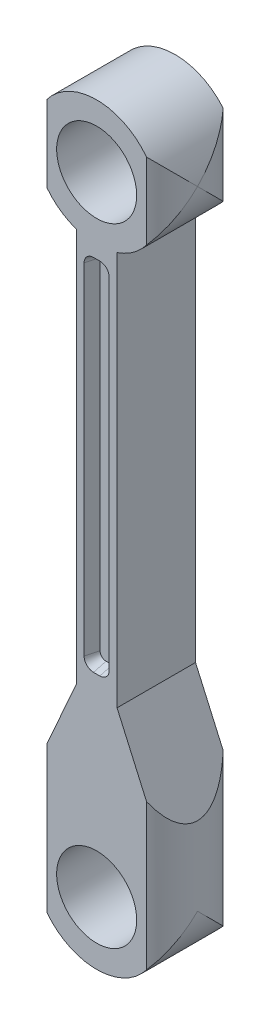
ISO-10303-21;
HEADER;
FILE_DESCRIPTION(('STEP AP214'),'2;1');
FILE_NAME('part.step','',(''),(''),'','','');
FILE_SCHEMA(('AUTOMOTIVE_DESIGN { 1 0 10303 214 1 1 1 1 }'));
ENDSEC;
DATA;
#1=APPLICATION_CONTEXT('core data for automotive mechanical design processes');
#2=APPLICATION_PROTOCOL_DEFINITION('international standard','automotive_design',2000,#1);
#3=PRODUCT_CONTEXT('',#1,'mechanical');
#4=PRODUCT('Part','Part','',(#3));
#5=PRODUCT_RELATED_PRODUCT_CATEGORY('part','',(#4));
#6=PRODUCT_DEFINITION_FORMATION('','',#4);
#7=PRODUCT_DEFINITION_CONTEXT('part definition',#1,'design');
#8=PRODUCT_DEFINITION('design','',#6,#7);
#9=PRODUCT_DEFINITION_SHAPE('','',#8);
#10=(LENGTH_UNIT() NAMED_UNIT(*) SI_UNIT(.MILLI.,.METRE.));
#11=(NAMED_UNIT(*) PLANE_ANGLE_UNIT() SI_UNIT($,.RADIAN.));
#12=(NAMED_UNIT(*) SI_UNIT($,.STERADIAN.) SOLID_ANGLE_UNIT());
#13=UNCERTAINTY_MEASURE_WITH_UNIT(LENGTH_MEASURE(1.E-05),#10,'distance_accuracy_value','');
#14=(GEOMETRIC_REPRESENTATION_CONTEXT(3) GLOBAL_UNCERTAINTY_ASSIGNED_CONTEXT((#13)) GLOBAL_UNIT_ASSIGNED_CONTEXT((#10,
#11,#12)) REPRESENTATION_CONTEXT('',''));
#15=CARTESIAN_POINT('',(0.,0.,0.));
#16=DIRECTION('',(0.,0.,1.));
#17=DIRECTION('',(1.,0.,0.));
#18=AXIS2_PLACEMENT_3D('',#15,#16,#17);
#19=CARTESIAN_POINT('',(0.,0.,-12.7));
#20=DIRECTION('',(0.,0.,1.));
#21=DIRECTION('',(1.,0.,0.));
#22=AXIS2_PLACEMENT_3D('',#19,#20,#21);
#23=PLANE('',#22);
#24=CARTESIAN_POINT('',(0.,0.,-12.7));
#25=DIRECTION('',(0.,0.,1.));
#26=DIRECTION('',(1.,0.,0.));
#27=AXIS2_PLACEMENT_3D('',#24,#25,#26);
#28=CIRCLE('',#27,6.477);
#29=CARTESIAN_POINT('',(6.477,0.,-12.7));
#30=VERTEX_POINT('',#29);
#31=EDGE_CURVE('E288',#30,#30,#28,.T.);
#32=ORIENTED_EDGE('',*,*,#31,.T.);
#33=EDGE_LOOP('',(#32));
#34=FACE_BOUND('',#33,.T.);
#35=CARTESIAN_POINT('',(0.,101.6,-12.7));
#36=DIRECTION('',(0.,0.,1.));
#37=DIRECTION('',(1.,0.,0.));
#38=AXIS2_PLACEMENT_3D('',#35,#36,#37);
#39=CIRCLE('',#38,6.477);
#40=CARTESIAN_POINT('',(6.477,101.6,-12.7));
#41=VERTEX_POINT('',#40);
#42=EDGE_CURVE('E524',#41,#41,#39,.T.);
#43=ORIENTED_EDGE('',*,*,#42,.T.);
#44=EDGE_LOOP('',(#43));
#45=FACE_BOUND('',#44,.T.);
#46=CARTESIAN_POINT('',(0.508000000000007,32.766,-12.7));
#47=DIRECTION('',(0.,0.,1.));
#48=DIRECTION('',(1.,0.,0.));
#49=AXIS2_PLACEMENT_3D('',#46,#47,#48);
#50=CIRCLE('',#49,1.524);
#51=CARTESIAN_POINT('',(0.508,31.242,-12.7));
#52=VERTEX_POINT('',#51);
#53=CARTESIAN_POINT('',(2.03200000000001,32.766,-12.7));
#54=VERTEX_POINT('',#53);
#55=EDGE_CURVE('E400',#52,#54,#50,.T.);
#56=ORIENTED_EDGE('',*,*,#55,.T.);
#57=DIRECTION('',(0.,1.,0.));
#58=VECTOR('',#57,1.);
#59=CARTESIAN_POINT('',(2.032,87.884,-12.7));
#60=LINE('',#59,#58);
#61=CARTESIAN_POINT('',(2.032,87.884,-12.7));
#62=VERTEX_POINT('',#61);
#63=EDGE_CURVE('E421',#54,#62,#60,.T.);
#64=ORIENTED_EDGE('',*,*,#63,.T.);
#65=CARTESIAN_POINT('',(0.508,87.884,-12.7));
#66=DIRECTION('',(0.,0.,1.));
#67=DIRECTION('',(-1.,0.,0.));
#68=AXIS2_PLACEMENT_3D('',#65,#66,#67);
#69=CIRCLE('',#68,1.524);
#70=CARTESIAN_POINT('',(0.50799999999999,89.408,-12.7));
#71=VERTEX_POINT('',#70);
#72=EDGE_CURVE('E418',#62,#71,#69,.T.);
#73=ORIENTED_EDGE('',*,*,#72,.T.);
#74=DIRECTION('',(-1.,0.,0.));
#75=VECTOR('',#74,1.);
#76=CARTESIAN_POINT('',(-0.507999999999988,89.408,-12.7));
#77=LINE('',#76,#75);
#78=CARTESIAN_POINT('',(-0.507999999999988,89.408,-12.7));
#79=VERTEX_POINT('',#78);
#80=EDGE_CURVE('E415',#71,#79,#77,.T.);
#81=ORIENTED_EDGE('',*,*,#80,.T.);
#82=CARTESIAN_POINT('',(-0.507999999999999,87.884,-12.7));
#83=DIRECTION('',(0.,0.,1.));
#84=DIRECTION('',(1.,0.,0.));
#85=AXIS2_PLACEMENT_3D('',#82,#83,#84);
#86=CIRCLE('',#85,1.524);
#87=CARTESIAN_POINT('',(-2.032,87.884,-12.7));
#88=VERTEX_POINT('',#87);
#89=EDGE_CURVE('E412',#79,#88,#86,.T.);
#90=ORIENTED_EDGE('',*,*,#89,.T.);
#91=DIRECTION('',(0.,-1.,0.));
#92=VECTOR('',#91,1.);
#93=CARTESIAN_POINT('',(-2.032,87.884,-12.7));
#94=LINE('',#93,#92);
#95=CARTESIAN_POINT('',(-2.03199999999999,32.766,-12.7));
#96=VERTEX_POINT('',#95);
#97=EDGE_CURVE('E409',#88,#96,#94,.T.);
#98=ORIENTED_EDGE('',*,*,#97,.T.);
#99=CARTESIAN_POINT('',(-0.507999999999992,32.766,-12.7));
#100=DIRECTION('',(0.,0.,1.));
#101=DIRECTION('',(1.,0.,0.));
#102=AXIS2_PLACEMENT_3D('',#99,#100,#101);
#103=CIRCLE('',#102,1.524);
#104=CARTESIAN_POINT('',(-0.507999999999981,31.242,-12.7));
#105=VERTEX_POINT('',#104);
#106=EDGE_CURVE('E406',#96,#105,#103,.T.);
#107=ORIENTED_EDGE('',*,*,#106,.T.);
#108=DIRECTION('',(1.,0.,0.));
#109=VECTOR('',#108,1.);
#110=CARTESIAN_POINT('',(-0.507999999999981,31.242,-12.7));
#111=LINE('',#110,#109);
#112=EDGE_CURVE('E403',#105,#52,#111,.T.);
#113=ORIENTED_EDGE('',*,*,#112,.T.);
#114=EDGE_LOOP('',(#56,#64,#73,#81,#90,#98,#107,#113));
#115=FACE_BOUND('',#114,.T.);
#116=DIRECTION('',(0.,1.,0.));
#117=VECTOR('',#116,1.);
#118=CARTESIAN_POINT('',(7.78261659931922,-10.16,-12.7));
#119=LINE('',#118,#117);
#120=CARTESIAN_POINT('',(7.78261659931922,-6.53119275997891,-12.7));
#121=VERTEX_POINT('',#120);
#122=CARTESIAN_POINT('',(7.78261659931922,18.0648705739055,-12.7));
#123=VERTEX_POINT('',#122);
#124=EDGE_CURVE('E336',#121,#123,#119,.T.);
#125=ORIENTED_EDGE('',*,*,#124,.F.);
#126=CARTESIAN_POINT('',(0.,0.,-12.7));
#127=DIRECTION('',(0.,0.,1.));
#128=DIRECTION('',(1.,0.,0.));
#129=AXIS2_PLACEMENT_3D('',#126,#127,#128);
#130=CIRCLE('',#129,10.16);
#131=CARTESIAN_POINT('',(-7.78261659931922,-6.53119275997891,-12.7));
#132=VERTEX_POINT('',#131);
#133=EDGE_CURVE('E257',#132,#121,#130,.T.);
#134=ORIENTED_EDGE('',*,*,#133,.F.);
#135=DIRECTION('',(0.,1.,0.));
#136=VECTOR('',#135,1.);
#137=CARTESIAN_POINT('',(-7.78261659931922,-10.16,-12.7));
#138=LINE('',#137,#136);
#139=CARTESIAN_POINT('',(-7.78261659931922,18.0648705739055,-12.7));
#140=VERTEX_POINT('',#139);
#141=EDGE_CURVE('E310',#140,#132,#138,.F.);
#142=ORIENTED_EDGE('',*,*,#141,.F.);
#143=DIRECTION('',(-0.405141586779863,-0.914253955234263,0.));
#144=VECTOR('',#143,1.);
#145=CARTESIAN_POINT('',(-10.16,12.7,-12.7));
#146=LINE('',#145,#144);
#147=CARTESIAN_POINT('',(-3.302,28.1759566274874,-12.7));
#148=VERTEX_POINT('',#147);
#149=EDGE_CURVE('E240',#148,#140,#146,.T.);
#150=ORIENTED_EDGE('',*,*,#149,.F.);
#151=DIRECTION('',(0.,-1.,0.));
#152=VECTOR('',#151,1.);
#153=CARTESIAN_POINT('',(-3.302,28.1759566274874,-12.7));
#154=LINE('',#153,#152);
#155=CARTESIAN_POINT('',(-3.302,91.9915455977561,-12.7));
#156=VERTEX_POINT('',#155);
#157=EDGE_CURVE('E278',#156,#148,#154,.T.);
#158=ORIENTED_EDGE('',*,*,#157,.F.);
#159=CARTESIAN_POINT('',(0.,101.6,-12.7));
#160=DIRECTION('',(0.,0.,1.));
#161=DIRECTION('',(1.,0.,0.));
#162=AXIS2_PLACEMENT_3D('',#159,#160,#161);
#163=CIRCLE('',#162,10.16);
#164=CARTESIAN_POINT('',(-7.78261659931922,95.0688072400211,-12.7));
#165=VERTEX_POINT('',#164);
#166=EDGE_CURVE('E303',#165,#156,#163,.T.);
#167=ORIENTED_EDGE('',*,*,#166,.F.);
#168=CARTESIAN_POINT('',(-7.78261659931922,108.131192759979,-12.7));
#169=VERTEX_POINT('',#168);
#170=EDGE_CURVE('E314',#169,#165,#138,.F.);
#171=ORIENTED_EDGE('',*,*,#170,.F.);
#172=CARTESIAN_POINT('',(7.78261659931922,108.131192759979,-12.7));
#173=VERTEX_POINT('',#172);
#174=EDGE_CURVE('E536',#173,#169,#163,.T.);
#175=ORIENTED_EDGE('',*,*,#174,.F.);
#176=CARTESIAN_POINT('',(7.78261659931922,95.0688072400211,-12.7));
#177=VERTEX_POINT('',#176);
#178=EDGE_CURVE('E332',#177,#173,#119,.T.);
#179=ORIENTED_EDGE('',*,*,#178,.F.);
#180=CARTESIAN_POINT('',(3.30199999999999,91.9915455977561,-12.7));
#181=VERTEX_POINT('',#180);
#182=EDGE_CURVE('E281',#181,#177,#163,.T.);
#183=ORIENTED_EDGE('',*,*,#182,.F.);
#184=DIRECTION('',(0.,1.,0.));
#185=VECTOR('',#184,1.);
#186=CARTESIAN_POINT('',(3.302,28.1759566274874,-12.7));
#187=LINE('',#186,#185);
#188=CARTESIAN_POINT('',(3.302,28.1759566274874,-12.7));
#189=VERTEX_POINT('',#188);
#190=EDGE_CURVE('E534',#189,#181,#187,.T.);
#191=ORIENTED_EDGE('',*,*,#190,.F.);
#192=DIRECTION('',(-0.405141586779863,0.914253955234263,0.));
#193=VECTOR('',#192,1.);
#194=CARTESIAN_POINT('',(10.16,12.7,-12.7));
#195=LINE('',#194,#193);
#196=EDGE_CURVE('E260',#123,#189,#195,.T.);
#197=ORIENTED_EDGE('',*,*,#196,.F.);
#198=EDGE_LOOP('',(#125,#134,#142,#150,#158,#167,#171,#175,#179,#183,#191,#197));
#199=FACE_BOUND('',#198,.T.);
#200=ADVANCED_FACE('F34',(#34,#45,#115,#199),#23,.F.);
#201=CARTESIAN_POINT('',(0.,0.,-12.7));
#202=DIRECTION('',(0.,0.,1.));
#203=DIRECTION('',(1.,0.,0.));
#204=AXIS2_PLACEMENT_3D('',#201,#202,#203);
#205=CYLINDRICAL_SURFACE('',#204,10.16);
#206=CARTESIAN_POINT('',(0.,0.,0.));
#207=DIRECTION('',(0.,0.,1.));
#208=DIRECTION('',(1.,0.,0.));
#209=AXIS2_PLACEMENT_3D('',#206,#207,#208);
#210=CIRCLE('',#209,10.16);
#211=CARTESIAN_POINT('',(-8.0728815942923,-6.16880724002109,0.));
#212=VERTEX_POINT('',#211);
#213=CARTESIAN_POINT('',(8.0728815942923,-6.16880724002109,0.));
#214=VERTEX_POINT('',#213);
#215=EDGE_CURVE('E285',#212,#214,#210,.T.);
#216=ORIENTED_EDGE('',*,*,#215,.F.);
#217=CARTESIAN_POINT('',(0.,0.,-6.16880724002109));
#218=DIRECTION('',(0.,0.707106781186547,0.707106781186547));
#219=DIRECTION('',(0.,-0.707106781186547,0.707106781186547));
#220=AXIS2_PLACEMENT_3D('',#217,#218,#219);
#221=ELLIPSE('',#220,14.3684097937106,10.16);
#222=CARTESIAN_POINT('',(-10.16,0.,-6.16880724002109));
#223=VERTEX_POINT('',#222);
#224=EDGE_CURVE('E243',#212,#223,#221,.F.);
#225=ORIENTED_EDGE('',*,*,#224,.T.);
#226=CARTESIAN_POINT('',(0.,0.,-6.16880724002109));
#227=DIRECTION('',(0.,-0.707106781186547,0.707106781186547));
#228=DIRECTION('',(0.,0.707106781186547,0.707106781186547));
#229=AXIS2_PLACEMENT_3D('',#226,#227,#228);
#230=ELLIPSE('',#229,14.3684097937106,10.16);
#231=EDGE_CURVE('E312',#223,#132,#230,.T.);
#232=ORIENTED_EDGE('',*,*,#231,.T.);
#233=ORIENTED_EDGE('',*,*,#133,.T.);
#234=CARTESIAN_POINT('',(10.16,0.,-6.16880724002109));
#235=VERTEX_POINT('',#234);
#236=EDGE_CURVE('E317',#121,#235,#230,.T.);
#237=ORIENTED_EDGE('',*,*,#236,.T.);
#238=EDGE_CURVE('E319',#235,#214,#221,.F.);
#239=ORIENTED_EDGE('',*,*,#238,.T.);
#240=EDGE_LOOP('',(#216,#225,#232,#233,#237,#239));
#241=FACE_BOUND('',#240,.T.);
#242=ADVANCED_FACE('F36',(#241),#205,.T.);
#243=CARTESIAN_POINT('',(-10.16,12.7,-12.7));
#244=DIRECTION('',(-0.914253955234263,0.405141586779863,0.));
#245=DIRECTION('',(-0.405141586779863,-0.914253955234263,0.));
#246=AXIS2_PLACEMENT_3D('',#243,#244,#245);
#247=PLANE('',#246);
#248=ORIENTED_EDGE('',*,*,#149,.T.);
#249=CARTESIAN_POINT('',(0.,35.6273431518332,-6.16880724002109));
#250=DIRECTION('',(-0.914253955234263,0.405141586779863,0.));
#251=DIRECTION('',(0.405141586779863,0.914253955234263,0.));
#252=AXIS2_PLACEMENT_3D('',#249,#250,#251);
#253=ELLIPSE('',#252,25.0776526812601,10.16);
#254=CARTESIAN_POINT('',(-8.0728815942923,17.4098503824968,0.));
#255=VERTEX_POINT('',#254);
#256=EDGE_CURVE('E233',#140,#255,#253,.T.);
#257=ORIENTED_EDGE('',*,*,#256,.T.);
#258=DIRECTION('',(-0.405141586779863,-0.914253955234263,0.));
#259=VECTOR('',#258,1.);
#260=CARTESIAN_POINT('',(-10.16,12.7,0.));
#261=LINE('',#260,#259);
#262=CARTESIAN_POINT('',(-3.302,28.1759566274874,0.));
#263=VERTEX_POINT('',#262);
#264=EDGE_CURVE('E237',#263,#255,#261,.T.);
#265=ORIENTED_EDGE('',*,*,#264,.F.);
#266=DIRECTION('',(0.,0.,1.));
#267=VECTOR('',#266,1.);
#268=CARTESIAN_POINT('',(-3.302,28.1759566274874,-12.7));
#269=LINE('',#268,#267);
#270=EDGE_CURVE('E253',#148,#263,#269,.T.);
#271=ORIENTED_EDGE('',*,*,#270,.F.);
#272=EDGE_LOOP('',(#248,#257,#265,#271));
#273=FACE_BOUND('',#272,.T.);
#274=ADVANCED_FACE('F235',(#273),#247,.T.);
#275=CARTESIAN_POINT('',(0.,101.6,-12.7));
#276=DIRECTION('',(0.,0.,1.));
#277=DIRECTION('',(1.,0.,0.));
#278=AXIS2_PLACEMENT_3D('',#275,#276,#277);
#279=CYLINDRICAL_SURFACE('',#278,10.16);
#280=CARTESIAN_POINT('',(0.,101.6,-6.16880724002109));
#281=DIRECTION('',(0.,-0.707106781186547,0.707106781186547));
#282=DIRECTION('',(0.,0.707106781186547,0.707106781186547));
#283=AXIS2_PLACEMENT_3D('',#280,#281,#282);
#284=ELLIPSE('',#283,14.3684097937106,10.16);
#285=CARTESIAN_POINT('',(10.16,101.6,-6.16880724002109));
#286=VERTEX_POINT('',#285);
#287=EDGE_CURVE('E330',#177,#286,#284,.T.);
#288=ORIENTED_EDGE('',*,*,#287,.T.);
#289=CARTESIAN_POINT('',(0.,101.6,-6.16880724002109));
#290=DIRECTION('',(0.,0.707106781186547,0.707106781186547));
#291=DIRECTION('',(0.,-0.707106781186547,0.707106781186547));
#292=AXIS2_PLACEMENT_3D('',#289,#290,#291);
#293=ELLIPSE('',#292,14.3684097937106,10.16);
#294=CARTESIAN_POINT('',(8.0728815942923,95.4311927599789,0.));
#295=VERTEX_POINT('',#294);
#296=EDGE_CURVE('E328',#286,#295,#293,.F.);
#297=ORIENTED_EDGE('',*,*,#296,.T.);
#298=CARTESIAN_POINT('',(0.,101.6,0.));
#299=DIRECTION('',(0.,0.,1.));
#300=DIRECTION('',(1.,0.,0.));
#301=AXIS2_PLACEMENT_3D('',#298,#299,#300);
#302=CIRCLE('',#301,10.16);
#303=CARTESIAN_POINT('',(3.30199999999999,91.9915455977561,0.));
#304=VERTEX_POINT('',#303);
#305=EDGE_CURVE('E262',#304,#295,#302,.T.);
#306=ORIENTED_EDGE('',*,*,#305,.F.);
#307=DIRECTION('',(0.,0.,1.));
#308=VECTOR('',#307,1.);
#309=CARTESIAN_POINT('',(3.30199999999999,91.9915455977561,-12.7));
#310=LINE('',#309,#308);
#311=EDGE_CURVE('E270',#181,#304,#310,.T.);
#312=ORIENTED_EDGE('',*,*,#311,.F.);
#313=ORIENTED_EDGE('',*,*,#182,.T.);
#314=EDGE_LOOP('',(#288,#297,#306,#312,#313));
#315=FACE_BOUND('',#314,.T.);
#316=ADVANCED_FACE('F379',(#315),#279,.T.);
#317=CARTESIAN_POINT('',(0.,101.6,-6.16880724002109));
#318=DIRECTION('',(0.,-0.707106781186547,0.707106781186547));
#319=DIRECTION('',(0.,0.707106781186547,0.707106781186547));
#320=AXIS2_PLACEMENT_3D('',#317,#318,#319);
#321=ELLIPSE('',#320,14.3684097937106,10.16);
#322=CARTESIAN_POINT('',(8.0728815942923,107.768807240021,0.));
#323=VERTEX_POINT('',#322);
#324=EDGE_CURVE('E57',#323,#286,#321,.F.);
#325=ORIENTED_EDGE('',*,*,#324,.T.);
#326=CARTESIAN_POINT('',(0.,101.6,-6.16880724002109));
#327=DIRECTION('',(0.,0.707106781186547,0.707106781186547));
#328=DIRECTION('',(0.,-0.707106781186547,0.707106781186547));
#329=AXIS2_PLACEMENT_3D('',#326,#327,#328);
#330=ELLIPSE('',#329,14.3684097937106,10.16);
#331=EDGE_CURVE('E325',#286,#173,#330,.T.);
#332=ORIENTED_EDGE('',*,*,#331,.T.);
#333=ORIENTED_EDGE('',*,*,#174,.T.);
#334=CARTESIAN_POINT('',(-10.16,101.6,-6.16880724002109));
#335=VERTEX_POINT('',#334);
#336=EDGE_CURVE('E320',#169,#335,#330,.T.);
#337=ORIENTED_EDGE('',*,*,#336,.T.);
#338=CARTESIAN_POINT('',(-8.0728815942923,107.768807240021,0.));
#339=VERTEX_POINT('',#338);
#340=EDGE_CURVE('E315',#335,#339,#321,.F.);
#341=ORIENTED_EDGE('',*,*,#340,.T.);
#342=EDGE_CURVE('E294',#323,#339,#302,.T.);
#343=ORIENTED_EDGE('',*,*,#342,.F.);
#344=EDGE_LOOP('',(#325,#332,#333,#337,#341,#343));
#345=FACE_BOUND('',#344,.T.);
#346=ADVANCED_FACE('F342',(#345),#279,.T.);
#347=CARTESIAN_POINT('',(-8.0728815942923,95.4311927599789,0.));
#348=VERTEX_POINT('',#347);
#349=CARTESIAN_POINT('',(-3.302,91.9915455977561,0.));
#350=VERTEX_POINT('',#349);
#351=EDGE_CURVE('E292',#348,#350,#302,.T.);
#352=ORIENTED_EDGE('',*,*,#351,.F.);
#353=EDGE_CURVE('E49',#348,#335,#293,.F.);
#354=ORIENTED_EDGE('',*,*,#353,.T.);
#355=EDGE_CURVE('E326',#335,#165,#284,.T.);
#356=ORIENTED_EDGE('',*,*,#355,.T.);
#357=ORIENTED_EDGE('',*,*,#166,.T.);
#358=DIRECTION('',(0.,0.,1.));
#359=VECTOR('',#358,1.);
#360=CARTESIAN_POINT('',(-3.302,91.9915455977561,-12.7));
#361=LINE('',#360,#359);
#362=EDGE_CURVE('E267',#156,#350,#361,.T.);
#363=ORIENTED_EDGE('',*,*,#362,.T.);
#364=EDGE_LOOP('',(#352,#354,#356,#357,#363));
#365=FACE_BOUND('',#364,.T.);
#366=ADVANCED_FACE('F300',(#365),#279,.T.);
#367=CARTESIAN_POINT('',(10.16,12.7,-12.7));
#368=DIRECTION('',(0.914253955234263,0.405141586779863,0.));
#369=DIRECTION('',(-0.405141586779863,0.914253955234263,0.));
#370=AXIS2_PLACEMENT_3D('',#367,#368,#369);
#371=PLANE('',#370);
#372=DIRECTION('',(-0.405141586779863,0.914253955234263,0.));
#373=VECTOR('',#372,1.);
#374=CARTESIAN_POINT('',(10.16,12.7,0.));
#375=LINE('',#374,#373);
#376=CARTESIAN_POINT('',(8.0728815942923,17.4098503824968,0.));
#377=VERTEX_POINT('',#376);
#378=CARTESIAN_POINT('',(3.302,28.1759566274874,0.));
#379=VERTEX_POINT('',#378);
#380=EDGE_CURVE('E287',#377,#379,#375,.T.);
#381=ORIENTED_EDGE('',*,*,#380,.F.);
#382=CARTESIAN_POINT('',(0.,35.6273431518332,-6.16880724002109));
#383=DIRECTION('',(0.914253955234263,0.405141586779863,0.));
#384=DIRECTION('',(-0.405141586779863,0.914253955234263,0.));
#385=AXIS2_PLACEMENT_3D('',#382,#383,#384);
#386=ELLIPSE('',#385,25.0776526812601,10.16);
#387=EDGE_CURVE('E392',#377,#123,#386,.T.);
#388=ORIENTED_EDGE('',*,*,#387,.T.);
#389=ORIENTED_EDGE('',*,*,#196,.T.);
#390=DIRECTION('',(0.,0.,1.));
#391=VECTOR('',#390,1.);
#392=CARTESIAN_POINT('',(3.302,28.1759566274874,-12.7));
#393=LINE('',#392,#391);
#394=EDGE_CURVE('E272',#189,#379,#393,.T.);
#395=ORIENTED_EDGE('',*,*,#394,.T.);
#396=EDGE_LOOP('',(#381,#388,#389,#395));
#397=FACE_BOUND('',#396,.T.);
#398=ADVANCED_FACE('F375',(#397),#371,.T.);
#399=CARTESIAN_POINT('',(0.,0.,0.));
#400=DIRECTION('',(0.,0.,1.));
#401=DIRECTION('',(1.,0.,0.));
#402=AXIS2_PLACEMENT_3D('',#399,#400,#401);
#403=PLANE('',#402);
#404=CARTESIAN_POINT('',(0.508000000000007,32.766,0.));
#405=DIRECTION('',(0.,0.,1.));
#406=DIRECTION('',(1.,0.,0.));
#407=AXIS2_PLACEMENT_3D('',#404,#405,#406);
#408=CIRCLE('',#407,1.524);
#409=CARTESIAN_POINT('',(0.507999999999996,31.242,0.));
#410=VERTEX_POINT('',#409);
#411=CARTESIAN_POINT('',(2.03200000000001,32.766,0.));
#412=VERTEX_POINT('',#411);
#413=EDGE_CURVE('E428',#410,#412,#408,.T.);
#414=ORIENTED_EDGE('',*,*,#413,.F.);
#415=DIRECTION('',(1.,0.,0.));
#416=VECTOR('',#415,1.);
#417=CARTESIAN_POINT('',(-0.507999999999981,31.242,0.));
#418=LINE('',#417,#416);
#419=CARTESIAN_POINT('',(-0.507999999999981,31.242,0.));
#420=VERTEX_POINT('',#419);
#421=EDGE_CURVE('E479',#420,#410,#418,.T.);
#422=ORIENTED_EDGE('',*,*,#421,.F.);
#423=CARTESIAN_POINT('',(-0.507999999999992,32.766,0.));
#424=DIRECTION('',(0.,0.,1.));
#425=DIRECTION('',(1.,0.,0.));
#426=AXIS2_PLACEMENT_3D('',#423,#424,#425);
#427=CIRCLE('',#426,1.524);
#428=CARTESIAN_POINT('',(-2.03199999999999,32.766,0.));
#429=VERTEX_POINT('',#428);
#430=EDGE_CURVE('E476',#429,#420,#427,.T.);
#431=ORIENTED_EDGE('',*,*,#430,.F.);
#432=DIRECTION('',(0.,-1.,0.));
#433=VECTOR('',#432,1.);
#434=CARTESIAN_POINT('',(-2.032,87.884,0.));
#435=LINE('',#434,#433);
#436=CARTESIAN_POINT('',(-2.032,87.884,0.));
#437=VERTEX_POINT('',#436);
#438=EDGE_CURVE('E473',#437,#429,#435,.T.);
#439=ORIENTED_EDGE('',*,*,#438,.F.);
#440=CARTESIAN_POINT('',(-0.507999999999999,87.884,0.));
#441=DIRECTION('',(0.,0.,1.));
#442=DIRECTION('',(1.,0.,0.));
#443=AXIS2_PLACEMENT_3D('',#440,#441,#442);
#444=CIRCLE('',#443,1.524);
#445=CARTESIAN_POINT('',(-0.507999999999988,89.408,0.));
#446=VERTEX_POINT('',#445);
#447=EDGE_CURVE('E470',#446,#437,#444,.T.);
#448=ORIENTED_EDGE('',*,*,#447,.F.);
#449=DIRECTION('',(-1.,0.,0.));
#450=VECTOR('',#449,1.);
#451=CARTESIAN_POINT('',(-0.507999999999988,89.408,0.));
#452=LINE('',#451,#450);
#453=CARTESIAN_POINT('',(0.50799999999999,89.408,0.));
#454=VERTEX_POINT('',#453);
#455=EDGE_CURVE('E467',#454,#446,#452,.T.);
#456=ORIENTED_EDGE('',*,*,#455,.F.);
#457=CARTESIAN_POINT('',(0.508,87.884,0.));
#458=DIRECTION('',(0.,0.,1.));
#459=DIRECTION('',(-1.,0.,0.));
#460=AXIS2_PLACEMENT_3D('',#457,#458,#459);
#461=CIRCLE('',#460,1.524);
#462=CARTESIAN_POINT('',(2.032,87.884,0.));
#463=VERTEX_POINT('',#462);
#464=EDGE_CURVE('E464',#463,#454,#461,.T.);
#465=ORIENTED_EDGE('',*,*,#464,.F.);
#466=DIRECTION('',(0.,1.,0.));
#467=VECTOR('',#466,1.);
#468=CARTESIAN_POINT('',(2.032,87.884,0.));
#469=LINE('',#468,#467);
#470=EDGE_CURVE('E461',#412,#463,#469,.T.);
#471=ORIENTED_EDGE('',*,*,#470,.F.);
#472=EDGE_LOOP('',(#414,#422,#431,#439,#448,#456,#465,#471));
#473=FACE_BOUND('',#472,.T.);
#474=CARTESIAN_POINT('',(0.,101.6,0.));
#475=DIRECTION('',(0.,0.,1.));
#476=DIRECTION('',(1.,0.,0.));
#477=AXIS2_PLACEMENT_3D('',#474,#475,#476);
#478=CIRCLE('',#477,6.477);
#479=CARTESIAN_POINT('',(6.477,101.6,0.));
#480=VERTEX_POINT('',#479);
#481=EDGE_CURVE('E485',#480,#480,#478,.T.);
#482=ORIENTED_EDGE('',*,*,#481,.F.);
#483=EDGE_LOOP('',(#482));
#484=FACE_BOUND('',#483,.T.);
#485=CARTESIAN_POINT('',(0.,0.,0.));
#486=DIRECTION('',(0.,0.,1.));
#487=DIRECTION('',(1.,0.,0.));
#488=AXIS2_PLACEMENT_3D('',#485,#486,#487);
#489=CIRCLE('',#488,6.477);
#490=CARTESIAN_POINT('',(6.477,0.,0.));
#491=VERTEX_POINT('',#490);
#492=EDGE_CURVE('E527',#491,#491,#489,.T.);
#493=ORIENTED_EDGE('',*,*,#492,.F.);
#494=EDGE_LOOP('',(#493));
#495=FACE_BOUND('',#494,.T.);
#496=ORIENTED_EDGE('',*,*,#215,.T.);
#497=DIRECTION('',(0.,1.,0.));
#498=VECTOR('',#497,1.);
#499=CARTESIAN_POINT('',(8.0728815942923,-10.16,0.));
#500=LINE('',#499,#498);
#501=EDGE_CURVE('E12',#214,#377,#500,.T.);
#502=ORIENTED_EDGE('',*,*,#501,.T.);
#503=ORIENTED_EDGE('',*,*,#380,.T.);
#504=DIRECTION('',(0.,1.,0.));
#505=VECTOR('',#504,1.);
#506=CARTESIAN_POINT('',(3.302,28.1759566274874,0.));
#507=LINE('',#506,#505);
#508=EDGE_CURVE('E290',#379,#304,#507,.T.);
#509=ORIENTED_EDGE('',*,*,#508,.T.);
#510=ORIENTED_EDGE('',*,*,#305,.T.);
#511=EDGE_CURVE('E38',#295,#323,#500,.T.);
#512=ORIENTED_EDGE('',*,*,#511,.T.);
#513=ORIENTED_EDGE('',*,*,#342,.T.);
#514=DIRECTION('',(0.,1.,0.));
#515=VECTOR('',#514,1.);
#516=CARTESIAN_POINT('',(-8.0728815942923,-10.16,0.));
#517=LINE('',#516,#515);
#518=EDGE_CURVE('E252',#339,#348,#517,.F.);
#519=ORIENTED_EDGE('',*,*,#518,.T.);
#520=ORIENTED_EDGE('',*,*,#351,.T.);
#521=DIRECTION('',(0.,-1.,0.));
#522=VECTOR('',#521,1.);
#523=CARTESIAN_POINT('',(-3.302,28.1759566274874,0.));
#524=LINE('',#523,#522);
#525=EDGE_CURVE('E256',#350,#263,#524,.T.);
#526=ORIENTED_EDGE('',*,*,#525,.T.);
#527=ORIENTED_EDGE('',*,*,#264,.T.);
#528=EDGE_CURVE('E246',#255,#212,#517,.F.);
#529=ORIENTED_EDGE('',*,*,#528,.T.);
#530=EDGE_LOOP('',(#496,#502,#503,#509,#510,#512,#513,#519,#520,#526,#527,#529));
#531=FACE_BOUND('',#530,.T.);
#532=ADVANCED_FACE('F254',(#473,#484,#495,#531),#403,.T.);
#533=CARTESIAN_POINT('',(-3.302,28.1759566274874,-12.7));
#534=DIRECTION('',(-1.,0.,0.));
#535=DIRECTION('',(0.,0.,1.));
#536=AXIS2_PLACEMENT_3D('',#533,#534,#535);
#537=PLANE('',#536);
#538=ORIENTED_EDGE('',*,*,#525,.F.);
#539=ORIENTED_EDGE('',*,*,#362,.F.);
#540=ORIENTED_EDGE('',*,*,#157,.T.);
#541=ORIENTED_EDGE('',*,*,#270,.T.);
#542=EDGE_LOOP('',(#538,#539,#540,#541));
#543=FACE_BOUND('',#542,.T.);
#544=ADVANCED_FACE('F306',(#543),#537,.T.);
#545=CARTESIAN_POINT('',(3.302,28.1759566274874,-12.7));
#546=DIRECTION('',(1.,0.,0.));
#547=DIRECTION('',(0.,0.,-1.));
#548=AXIS2_PLACEMENT_3D('',#545,#546,#547);
#549=PLANE('',#548);
#550=ORIENTED_EDGE('',*,*,#508,.F.);
#551=ORIENTED_EDGE('',*,*,#394,.F.);
#552=ORIENTED_EDGE('',*,*,#190,.T.);
#553=ORIENTED_EDGE('',*,*,#311,.T.);
#554=EDGE_LOOP('',(#550,#551,#552,#553));
#555=FACE_BOUND('',#554,.T.);
#556=ADVANCED_FACE('F382',(#555),#549,.T.);
#557=CARTESIAN_POINT('',(0.,0.,-12.7));
#558=DIRECTION('',(0.,0.,1.));
#559=DIRECTION('',(1.,0.,0.));
#560=AXIS2_PLACEMENT_3D('',#557,#558,#559);
#561=CYLINDRICAL_SURFACE('',#560,6.477);
#562=ORIENTED_EDGE('',*,*,#31,.F.);
#563=EDGE_LOOP('',(#562));
#564=FACE_BOUND('',#563,.T.);
#565=ORIENTED_EDGE('',*,*,#492,.T.);
#566=EDGE_LOOP('',(#565));
#567=FACE_BOUND('',#566,.T.);
#568=ADVANCED_FACE('F371',(#564,#567),#561,.F.);
#569=CARTESIAN_POINT('',(0.,101.6,-12.7));
#570=DIRECTION('',(0.,0.,1.));
#571=DIRECTION('',(1.,0.,0.));
#572=AXIS2_PLACEMENT_3D('',#569,#570,#571);
#573=CYLINDRICAL_SURFACE('',#572,6.477);
#574=ORIENTED_EDGE('',*,*,#42,.F.);
#575=EDGE_LOOP('',(#574));
#576=FACE_BOUND('',#575,.T.);
#577=ORIENTED_EDGE('',*,*,#481,.T.);
#578=EDGE_LOOP('',(#577));
#579=FACE_BOUND('',#578,.T.);
#580=ADVANCED_FACE('F544',(#576,#579),#573,.F.);
#581=CARTESIAN_POINT('',(0.508000000000007,32.766,0.));
#582=DIRECTION('',(0.,0.,1.));
#583=DIRECTION('',(1.,0.,0.));
#584=AXIS2_PLACEMENT_3D('',#581,#582,#583);
#585=CONICAL_SURFACE('',#584,1.524,0.26179938779915);
#586=ORIENTED_EDGE('',*,*,#413,.T.);
#587=DIRECTION('',(0.258819045102521,0.,0.965925826289068));
#588=VECTOR('',#587,1.);
#589=CARTESIAN_POINT('',(2.03200000000001,32.766,0.));
#590=LINE('',#589,#588);
#591=CARTESIAN_POINT('',(1.48752724097996,32.766,-2.032));
#592=VERTEX_POINT('',#591);
#593=EDGE_CURVE('E487',#592,#412,#590,.T.);
#594=ORIENTED_EDGE('',*,*,#593,.F.);
#595=CARTESIAN_POINT('',(0.508000000000007,32.766,-2.032));
#596=DIRECTION('',(0.,0.,1.));
#597=DIRECTION('',(1.,0.,0.));
#598=AXIS2_PLACEMENT_3D('',#595,#596,#597);
#599=CIRCLE('',#598,0.979527240979956);
#600=CARTESIAN_POINT('',(0.507999999999996,31.78647275902,-2.032));
#601=VERTEX_POINT('',#600);
#602=EDGE_CURVE('E482',#601,#592,#599,.T.);
#603=ORIENTED_EDGE('',*,*,#602,.F.);
#604=DIRECTION('',(0.,-0.258819045102521,0.965925826289068));
#605=VECTOR('',#604,1.);
#606=CARTESIAN_POINT('',(0.507999999999996,31.242,0.));
#607=LINE('',#606,#605);
#608=EDGE_CURVE('E483',#601,#410,#607,.T.);
#609=ORIENTED_EDGE('',*,*,#608,.T.);
#610=EDGE_LOOP('',(#586,#594,#603,#609));
#611=FACE_BOUND('',#610,.T.);
#612=ADVANCED_FACE('F549',(#611),#585,.F.);
#613=CARTESIAN_POINT('',(-0.507999999999981,31.242,0.));
#614=DIRECTION('',(0.,-0.965925826289068,-0.258819045102521));
#615=DIRECTION('',(0.,0.258819045102521,-0.965925826289068));
#616=AXIS2_PLACEMENT_3D('',#613,#614,#615);
#617=PLANE('',#616);
#618=ORIENTED_EDGE('',*,*,#421,.T.);
#619=ORIENTED_EDGE('',*,*,#608,.F.);
#620=DIRECTION('',(1.,0.,0.));
#621=VECTOR('',#620,1.);
#622=CARTESIAN_POINT('',(0.508000000000007,31.78647275902,-2.032));
#623=LINE('',#622,#621);
#624=CARTESIAN_POINT('',(-0.507999999999985,31.78647275902,-2.032));
#625=VERTEX_POINT('',#624);
#626=EDGE_CURVE('E491',#625,#601,#623,.T.);
#627=ORIENTED_EDGE('',*,*,#626,.F.);
#628=DIRECTION('',(0.,-0.258819045102521,0.965925826289068));
#629=VECTOR('',#628,1.);
#630=CARTESIAN_POINT('',(-0.507999999999982,31.242,0.));
#631=LINE('',#630,#629);
#632=EDGE_CURVE('E486',#625,#420,#631,.T.);
#633=ORIENTED_EDGE('',*,*,#632,.T.);
#634=EDGE_LOOP('',(#618,#619,#627,#633));
#635=FACE_BOUND('',#634,.T.);
#636=ADVANCED_FACE('F555',(#635),#617,.F.);
#637=CARTESIAN_POINT('',(-0.507999999999992,32.766,0.));
#638=DIRECTION('',(0.,0.,1.));
#639=DIRECTION('',(1.,0.,0.));
#640=AXIS2_PLACEMENT_3D('',#637,#638,#639);
#641=CONICAL_SURFACE('',#640,1.524,0.26179938779915);
#642=ORIENTED_EDGE('',*,*,#430,.T.);
#643=ORIENTED_EDGE('',*,*,#632,.F.);
#644=CARTESIAN_POINT('',(-0.507999999999992,32.766,-2.032));
#645=DIRECTION('',(0.,0.,1.));
#646=DIRECTION('',(1.,0.,0.));
#647=AXIS2_PLACEMENT_3D('',#644,#645,#646);
#648=CIRCLE('',#647,0.979527240979956);
#649=CARTESIAN_POINT('',(-1.48752724097995,32.766,-2.032));
#650=VERTEX_POINT('',#649);
#651=EDGE_CURVE('E507',#650,#625,#648,.T.);
#652=ORIENTED_EDGE('',*,*,#651,.F.);
#653=DIRECTION('',(-0.258819045102521,0.,0.965925826289068));
#654=VECTOR('',#653,1.);
#655=CARTESIAN_POINT('',(-2.03199999999999,32.766,0.));
#656=LINE('',#655,#654);
#657=EDGE_CURVE('E499',#650,#429,#656,.T.);
#658=ORIENTED_EDGE('',*,*,#657,.T.);
#659=EDGE_LOOP('',(#642,#643,#652,#658));
#660=FACE_BOUND('',#659,.T.);
#661=ADVANCED_FACE('F563',(#660),#641,.F.);
#662=CARTESIAN_POINT('',(-2.032,87.884,0.));
#663=DIRECTION('',(-0.965925826289068,0.,-0.258819045102521));
#664=DIRECTION('',(-0.258819045102521,0.,0.965925826289068));
#665=AXIS2_PLACEMENT_3D('',#662,#663,#664);
#666=PLANE('',#665);
#667=ORIENTED_EDGE('',*,*,#438,.T.);
#668=ORIENTED_EDGE('',*,*,#657,.F.);
#669=DIRECTION('',(0.,-1.,0.));
#670=VECTOR('',#669,1.);
#671=CARTESIAN_POINT('',(-1.48752724097995,32.766,-2.032));
#672=LINE('',#671,#670);
#673=CARTESIAN_POINT('',(-1.48752724097995,87.884,-2.032));
#674=VERTEX_POINT('',#673);
#675=EDGE_CURVE('E510',#674,#650,#672,.T.);
#676=ORIENTED_EDGE('',*,*,#675,.F.);
#677=DIRECTION('',(-0.258819045102521,0.,0.965925826289068));
#678=VECTOR('',#677,1.);
#679=CARTESIAN_POINT('',(-2.032,87.884,0.));
#680=LINE('',#679,#678);
#681=EDGE_CURVE('E497',#674,#437,#680,.T.);
#682=ORIENTED_EDGE('',*,*,#681,.T.);
#683=EDGE_LOOP('',(#667,#668,#676,#682));
#684=FACE_BOUND('',#683,.T.);
#685=ADVANCED_FACE('F567',(#684),#666,.F.);
#686=CARTESIAN_POINT('',(-0.507999999999999,87.884,0.));
#687=DIRECTION('',(0.,0.,1.));
#688=DIRECTION('',(1.,0.,0.));
#689=AXIS2_PLACEMENT_3D('',#686,#687,#688);
#690=CONICAL_SURFACE('',#689,1.524,0.26179938779915);
#691=ORIENTED_EDGE('',*,*,#447,.T.);
#692=ORIENTED_EDGE('',*,*,#681,.F.);
#693=CARTESIAN_POINT('',(-0.507999999999999,87.884,-2.032));
#694=DIRECTION('',(0.,0.,1.));
#695=DIRECTION('',(1.,0.,0.));
#696=AXIS2_PLACEMENT_3D('',#693,#694,#695);
#697=CIRCLE('',#696,0.979527240979956);
#698=CARTESIAN_POINT('',(-0.507999999999988,88.86352724098,-2.032));
#699=VERTEX_POINT('',#698);
#700=EDGE_CURVE('E513',#699,#674,#697,.T.);
#701=ORIENTED_EDGE('',*,*,#700,.F.);
#702=DIRECTION('',(0.,0.258819045102521,0.965925826289068));
#703=VECTOR('',#702,1.);
#704=CARTESIAN_POINT('',(-0.507999999999988,89.408,0.));
#705=LINE('',#704,#703);
#706=EDGE_CURVE('E495',#699,#446,#705,.T.);
#707=ORIENTED_EDGE('',*,*,#706,.T.);
#708=EDGE_LOOP('',(#691,#692,#701,#707));
#709=FACE_BOUND('',#708,.T.);
#710=ADVANCED_FACE('F571',(#709),#690,.F.);
#711=CARTESIAN_POINT('',(-0.507999999999988,89.408,0.));
#712=DIRECTION('',(0.,0.965925826289068,-0.258819045102521));
#713=DIRECTION('',(0.,0.258819045102521,0.965925826289068));
#714=AXIS2_PLACEMENT_3D('',#711,#712,#713);
#715=PLANE('',#714);
#716=ORIENTED_EDGE('',*,*,#455,.T.);
#717=ORIENTED_EDGE('',*,*,#706,.F.);
#718=DIRECTION('',(-1.,0.,0.));
#719=VECTOR('',#718,1.);
#720=CARTESIAN_POINT('',(0.508000000000007,88.86352724098,-2.032));
#721=LINE('',#720,#719);
#722=CARTESIAN_POINT('',(0.507999999999993,88.86352724098,-2.032));
#723=VERTEX_POINT('',#722);
#724=EDGE_CURVE('E516',#723,#699,#721,.T.);
#725=ORIENTED_EDGE('',*,*,#724,.F.);
#726=DIRECTION('',(0.,0.258819045102521,0.965925826289068));
#727=VECTOR('',#726,1.);
#728=CARTESIAN_POINT('',(0.507999999999989,89.408,0.));
#729=LINE('',#728,#727);
#730=EDGE_CURVE('E493',#723,#454,#729,.T.);
#731=ORIENTED_EDGE('',*,*,#730,.T.);
#732=EDGE_LOOP('',(#716,#717,#725,#731));
#733=FACE_BOUND('',#732,.T.);
#734=ADVANCED_FACE('F575',(#733),#715,.F.);
#735=CARTESIAN_POINT('',(0.508,87.884,0.));
#736=DIRECTION('',(0.,0.,1.));
#737=DIRECTION('',(-1.,0.,0.));
#738=AXIS2_PLACEMENT_3D('',#735,#736,#737);
#739=CONICAL_SURFACE('',#738,1.524,0.26179938779915);
#740=ORIENTED_EDGE('',*,*,#464,.T.);
#741=ORIENTED_EDGE('',*,*,#730,.F.);
#742=CARTESIAN_POINT('',(0.508,87.884,-2.032));
#743=DIRECTION('',(0.,0.,1.));
#744=DIRECTION('',(1.,0.,0.));
#745=AXIS2_PLACEMENT_3D('',#742,#743,#744);
#746=CIRCLE('',#745,0.979527240979956);
#747=CARTESIAN_POINT('',(1.48752724097996,87.884,-2.032));
#748=VERTEX_POINT('',#747);
#749=EDGE_CURVE('E519',#748,#723,#746,.T.);
#750=ORIENTED_EDGE('',*,*,#749,.F.);
#751=DIRECTION('',(0.258819045102521,0.,0.965925826289068));
#752=VECTOR('',#751,1.);
#753=CARTESIAN_POINT('',(2.032,87.884,0.));
#754=LINE('',#753,#752);
#755=EDGE_CURVE('E490',#748,#463,#754,.T.);
#756=ORIENTED_EDGE('',*,*,#755,.T.);
#757=EDGE_LOOP('',(#740,#741,#750,#756));
#758=FACE_BOUND('',#757,.T.);
#759=ADVANCED_FACE('F579',(#758),#739,.F.);
#760=CARTESIAN_POINT('',(2.032,87.884,0.));
#761=DIRECTION('',(0.965925826289068,0.,-0.258819045102521));
#762=DIRECTION('',(-0.258819045102521,0.,-0.965925826289068));
#763=AXIS2_PLACEMENT_3D('',#760,#761,#762);
#764=PLANE('',#763);
#765=ORIENTED_EDGE('',*,*,#470,.T.);
#766=ORIENTED_EDGE('',*,*,#755,.F.);
#767=DIRECTION('',(0.,1.,0.));
#768=VECTOR('',#767,1.);
#769=CARTESIAN_POINT('',(1.48752724097996,32.766,-2.032));
#770=LINE('',#769,#768);
#771=EDGE_CURVE('E504',#592,#748,#770,.T.);
#772=ORIENTED_EDGE('',*,*,#771,.F.);
#773=ORIENTED_EDGE('',*,*,#593,.T.);
#774=EDGE_LOOP('',(#765,#766,#772,#773));
#775=FACE_BOUND('',#774,.T.);
#776=ADVANCED_FACE('F583',(#775),#764,.F.);
#777=CARTESIAN_POINT('',(0.508000000000007,32.766,-2.032));
#778=DIRECTION('',(0.,0.,1.));
#779=DIRECTION('',(1.,0.,0.));
#780=AXIS2_PLACEMENT_3D('',#777,#778,#779);
#781=PLANE('',#780);
#782=ORIENTED_EDGE('',*,*,#602,.T.);
#783=ORIENTED_EDGE('',*,*,#771,.T.);
#784=ORIENTED_EDGE('',*,*,#749,.T.);
#785=ORIENTED_EDGE('',*,*,#724,.T.);
#786=ORIENTED_EDGE('',*,*,#700,.T.);
#787=ORIENTED_EDGE('',*,*,#675,.T.);
#788=ORIENTED_EDGE('',*,*,#651,.T.);
#789=ORIENTED_EDGE('',*,*,#626,.T.);
#790=EDGE_LOOP('',(#782,#783,#784,#785,#786,#787,#788,#789));
#791=FACE_BOUND('',#790,.T.);
#792=ADVANCED_FACE('F586',(#791),#781,.T.);
#793=CARTESIAN_POINT('',(0.508000000000007,32.766,-12.7));
#794=DIRECTION('',(0.,0.,-1.));
#795=DIRECTION('',(1.,0.,0.));
#796=AXIS2_PLACEMENT_3D('',#793,#794,#795);
#797=CONICAL_SURFACE('',#796,1.524,0.26179938779915);
#798=ORIENTED_EDGE('',*,*,#55,.F.);
#799=DIRECTION('',(0.,-0.258819045102521,-0.965925826289068));
#800=VECTOR('',#799,1.);
#801=CARTESIAN_POINT('',(0.507999999999996,31.242,-12.7));
#802=LINE('',#801,#800);
#803=CARTESIAN_POINT('',(0.508,31.78647275902,-10.668));
#804=VERTEX_POINT('',#803);
#805=EDGE_CURVE('E430',#804,#52,#802,.T.);
#806=ORIENTED_EDGE('',*,*,#805,.F.);
#807=CARTESIAN_POINT('',(0.508000000000007,32.766,-10.668));
#808=DIRECTION('',(0.,0.,-1.));
#809=DIRECTION('',(-1.,0.,0.));
#810=AXIS2_PLACEMENT_3D('',#807,#808,#809);
#811=CIRCLE('',#810,0.979527240979956);
#812=CARTESIAN_POINT('',(1.48752724097996,32.766,-10.668));
#813=VERTEX_POINT('',#812);
#814=EDGE_CURVE('E424',#804,#813,#811,.F.);
#815=ORIENTED_EDGE('',*,*,#814,.T.);
#816=DIRECTION('',(0.258819045102521,0.,-0.965925826289068));
#817=VECTOR('',#816,1.);
#818=CARTESIAN_POINT('',(2.03200000000001,32.766,-12.7));
#819=LINE('',#818,#817);
#820=EDGE_CURVE('E425',#813,#54,#819,.T.);
#821=ORIENTED_EDGE('',*,*,#820,.T.);
#822=EDGE_LOOP('',(#798,#806,#815,#821));
#823=FACE_BOUND('',#822,.T.);
#824=ADVANCED_FACE('F591',(#823),#797,.F.);
#825=CARTESIAN_POINT('',(2.032,87.884,-12.7));
#826=DIRECTION('',(0.965925826289068,0.,0.258819045102521));
#827=DIRECTION('',(0.258819045102521,0.,-0.965925826289068));
#828=AXIS2_PLACEMENT_3D('',#825,#826,#827);
#829=PLANE('',#828);
#830=ORIENTED_EDGE('',*,*,#63,.F.);
#831=ORIENTED_EDGE('',*,*,#820,.F.);
#832=DIRECTION('',(0.,-1.,0.));
#833=VECTOR('',#832,1.);
#834=CARTESIAN_POINT('',(1.48752724097996,32.766,-10.668));
#835=LINE('',#834,#833);
#836=CARTESIAN_POINT('',(1.48752724097996,87.884,-10.668));
#837=VERTEX_POINT('',#836);
#838=EDGE_CURVE('E434',#813,#837,#835,.F.);
#839=ORIENTED_EDGE('',*,*,#838,.T.);
#840=DIRECTION('',(0.258819045102521,0.,-0.965925826289068));
#841=VECTOR('',#840,1.);
#842=CARTESIAN_POINT('',(2.032,87.884,-12.7));
#843=LINE('',#842,#841);
#844=EDGE_CURVE('E429',#837,#62,#843,.T.);
#845=ORIENTED_EDGE('',*,*,#844,.T.);
#846=EDGE_LOOP('',(#830,#831,#839,#845));
#847=FACE_BOUND('',#846,.T.);
#848=ADVANCED_FACE('F593',(#847),#829,.F.);
#849=CARTESIAN_POINT('',(0.508,87.884,-12.7));
#850=DIRECTION('',(0.,0.,-1.));
#851=DIRECTION('',(-1.,0.,0.));
#852=AXIS2_PLACEMENT_3D('',#849,#850,#851);
#853=CONICAL_SURFACE('',#852,1.524,0.26179938779915);
#854=ORIENTED_EDGE('',*,*,#72,.F.);
#855=ORIENTED_EDGE('',*,*,#844,.F.);
#856=CARTESIAN_POINT('',(0.508,87.884,-10.668));
#857=DIRECTION('',(0.,0.,-1.));
#858=DIRECTION('',(-1.,0.,0.));
#859=AXIS2_PLACEMENT_3D('',#856,#857,#858);
#860=CIRCLE('',#859,0.979527240979956);
#861=CARTESIAN_POINT('',(0.50799999999999,88.86352724098,-10.668));
#862=VERTEX_POINT('',#861);
#863=EDGE_CURVE('E449',#837,#862,#860,.F.);
#864=ORIENTED_EDGE('',*,*,#863,.T.);
#865=DIRECTION('',(0.,0.258819045102521,-0.965925826289068));
#866=VECTOR('',#865,1.);
#867=CARTESIAN_POINT('',(0.50799999999999,89.408,-12.7));
#868=LINE('',#867,#866);
#869=EDGE_CURVE('E442',#862,#71,#868,.T.);
#870=ORIENTED_EDGE('',*,*,#869,.T.);
#871=EDGE_LOOP('',(#854,#855,#864,#870));
#872=FACE_BOUND('',#871,.T.);
#873=ADVANCED_FACE('F596',(#872),#853,.F.);
#874=CARTESIAN_POINT('',(-0.507999999999988,89.408,-12.7));
#875=DIRECTION('',(0.,0.965925826289068,0.258819045102521));
#876=DIRECTION('',(0.,-0.258819045102521,0.965925826289068));
#877=AXIS2_PLACEMENT_3D('',#874,#875,#876);
#878=PLANE('',#877);
#879=ORIENTED_EDGE('',*,*,#80,.F.);
#880=ORIENTED_EDGE('',*,*,#869,.F.);
#881=DIRECTION('',(1.,0.,0.));
#882=VECTOR('',#881,1.);
#883=CARTESIAN_POINT('',(0.508000000000007,88.86352724098,-10.668));
#884=LINE('',#883,#882);
#885=CARTESIAN_POINT('',(-0.507999999999992,88.86352724098,-10.668));
#886=VERTEX_POINT('',#885);
#887=EDGE_CURVE('E451',#862,#886,#884,.F.);
#888=ORIENTED_EDGE('',*,*,#887,.T.);
#889=DIRECTION('',(0.,0.258819045102521,-0.965925826289068));
#890=VECTOR('',#889,1.);
#891=CARTESIAN_POINT('',(-0.507999999999988,89.408,-12.7));
#892=LINE('',#891,#890);
#893=EDGE_CURVE('E440',#886,#79,#892,.T.);
#894=ORIENTED_EDGE('',*,*,#893,.T.);
#895=EDGE_LOOP('',(#879,#880,#888,#894));
#896=FACE_BOUND('',#895,.T.);
#897=ADVANCED_FACE('F600',(#896),#878,.F.);
#898=CARTESIAN_POINT('',(-0.507999999999999,87.884,-12.7));
#899=DIRECTION('',(0.,0.,-1.));
#900=DIRECTION('',(1.,0.,0.));
#901=AXIS2_PLACEMENT_3D('',#898,#899,#900);
#902=CONICAL_SURFACE('',#901,1.524,0.26179938779915);
#903=ORIENTED_EDGE('',*,*,#89,.F.);
#904=ORIENTED_EDGE('',*,*,#893,.F.);
#905=CARTESIAN_POINT('',(-0.507999999999999,87.884,-10.668));
#906=DIRECTION('',(0.,0.,-1.));
#907=DIRECTION('',(-1.,0.,0.));
#908=AXIS2_PLACEMENT_3D('',#905,#906,#907);
#909=CIRCLE('',#908,0.979527240979956);
#910=CARTESIAN_POINT('',(-1.48752724097996,87.884,-10.668));
#911=VERTEX_POINT('',#910);
#912=EDGE_CURVE('E453',#886,#911,#909,.F.);
#913=ORIENTED_EDGE('',*,*,#912,.T.);
#914=DIRECTION('',(-0.258819045102521,0.,-0.965925826289068));
#915=VECTOR('',#914,1.);
#916=CARTESIAN_POINT('',(-2.032,87.884,-12.7));
#917=LINE('',#916,#915);
#918=EDGE_CURVE('E438',#911,#88,#917,.T.);
#919=ORIENTED_EDGE('',*,*,#918,.T.);
#920=EDGE_LOOP('',(#903,#904,#913,#919));
#921=FACE_BOUND('',#920,.T.);
#922=ADVANCED_FACE('F604',(#921),#902,.F.);
#923=CARTESIAN_POINT('',(-2.032,87.884,-12.7));
#924=DIRECTION('',(-0.965925826289068,0.,0.258819045102521));
#925=DIRECTION('',(0.258819045102521,0.,0.965925826289068));
#926=AXIS2_PLACEMENT_3D('',#923,#924,#925);
#927=PLANE('',#926);
#928=ORIENTED_EDGE('',*,*,#97,.F.);
#929=ORIENTED_EDGE('',*,*,#918,.F.);
#930=DIRECTION('',(0.,1.,0.));
#931=VECTOR('',#930,1.);
#932=CARTESIAN_POINT('',(-1.48752724097995,32.766,-10.668));
#933=LINE('',#932,#931);
#934=CARTESIAN_POINT('',(-1.48752724097995,32.766,-10.668));
#935=VERTEX_POINT('',#934);
#936=EDGE_CURVE('E455',#911,#935,#933,.F.);
#937=ORIENTED_EDGE('',*,*,#936,.T.);
#938=DIRECTION('',(-0.258819045102521,0.,-0.965925826289068));
#939=VECTOR('',#938,1.);
#940=CARTESIAN_POINT('',(-2.03199999999999,32.766,-12.7));
#941=LINE('',#940,#939);
#942=EDGE_CURVE('E436',#935,#96,#941,.T.);
#943=ORIENTED_EDGE('',*,*,#942,.T.);
#944=EDGE_LOOP('',(#928,#929,#937,#943));
#945=FACE_BOUND('',#944,.T.);
#946=ADVANCED_FACE('F608',(#945),#927,.F.);
#947=CARTESIAN_POINT('',(-0.507999999999992,32.766,-12.7));
#948=DIRECTION('',(0.,0.,-1.));
#949=DIRECTION('',(1.,0.,0.));
#950=AXIS2_PLACEMENT_3D('',#947,#948,#949);
#951=CONICAL_SURFACE('',#950,1.524,0.26179938779915);
#952=ORIENTED_EDGE('',*,*,#106,.F.);
#953=ORIENTED_EDGE('',*,*,#942,.F.);
#954=CARTESIAN_POINT('',(-0.507999999999992,32.766,-10.668));
#955=DIRECTION('',(0.,0.,-1.));
#956=DIRECTION('',(-1.,0.,0.));
#957=AXIS2_PLACEMENT_3D('',#954,#955,#956);
#958=CIRCLE('',#957,0.979527240979956);
#959=CARTESIAN_POINT('',(-0.507999999999981,31.78647275902,-10.668));
#960=VERTEX_POINT('',#959);
#961=EDGE_CURVE('E457',#935,#960,#958,.F.);
#962=ORIENTED_EDGE('',*,*,#961,.T.);
#963=DIRECTION('',(0.,-0.258819045102521,-0.965925826289068));
#964=VECTOR('',#963,1.);
#965=CARTESIAN_POINT('',(-0.507999999999981,31.242,-12.7));
#966=LINE('',#965,#964);
#967=EDGE_CURVE('E433',#960,#105,#966,.T.);
#968=ORIENTED_EDGE('',*,*,#967,.T.);
#969=EDGE_LOOP('',(#952,#953,#962,#968));
#970=FACE_BOUND('',#969,.T.);
#971=ADVANCED_FACE('F612',(#970),#951,.F.);
#972=CARTESIAN_POINT('',(-0.507999999999981,31.242,-12.7));
#973=DIRECTION('',(0.,-0.965925826289068,0.258819045102521));
#974=DIRECTION('',(0.,-0.258819045102521,-0.965925826289068));
#975=AXIS2_PLACEMENT_3D('',#972,#973,#974);
#976=PLANE('',#975);
#977=ORIENTED_EDGE('',*,*,#112,.F.);
#978=ORIENTED_EDGE('',*,*,#967,.F.);
#979=DIRECTION('',(-1.,0.,0.));
#980=VECTOR('',#979,1.);
#981=CARTESIAN_POINT('',(0.508000000000007,31.78647275902,-10.668));
#982=LINE('',#981,#980);
#983=EDGE_CURVE('E447',#960,#804,#982,.F.);
#984=ORIENTED_EDGE('',*,*,#983,.T.);
#985=ORIENTED_EDGE('',*,*,#805,.T.);
#986=EDGE_LOOP('',(#977,#978,#984,#985));
#987=FACE_BOUND('',#986,.T.);
#988=ADVANCED_FACE('F616',(#987),#976,.F.);
#989=CARTESIAN_POINT('',(0.508000000000007,32.766,-10.668));
#990=DIRECTION('',(0.,0.,-1.));
#991=DIRECTION('',(1.,0.,0.));
#992=AXIS2_PLACEMENT_3D('',#989,#990,#991);
#993=PLANE('',#992);
#994=ORIENTED_EDGE('',*,*,#814,.F.);
#995=ORIENTED_EDGE('',*,*,#983,.F.);
#996=ORIENTED_EDGE('',*,*,#961,.F.);
#997=ORIENTED_EDGE('',*,*,#936,.F.);
#998=ORIENTED_EDGE('',*,*,#912,.F.);
#999=ORIENTED_EDGE('',*,*,#887,.F.);
#1000=ORIENTED_EDGE('',*,*,#863,.F.);
#1001=ORIENTED_EDGE('',*,*,#838,.F.);
#1002=EDGE_LOOP('',(#994,#995,#996,#997,#998,#999,#1000,#1001));
#1003=FACE_BOUND('',#1002,.T.);
#1004=ADVANCED_FACE('F620',(#1003),#993,.T.);
#1005=CARTESIAN_POINT('',(0.,-10.16,-6.16880724002109));
#1006=DIRECTION('',(0.,1.,0.));
#1007=DIRECTION('',(0.,0.,1.));
#1008=AXIS2_PLACEMENT_3D('',#1005,#1006,#1007);
#1009=CYLINDRICAL_SURFACE('',#1008,10.16);
#1010=ORIENTED_EDGE('',*,*,#231,.F.);
#1011=ORIENTED_EDGE('',*,*,#224,.F.);
#1012=ORIENTED_EDGE('',*,*,#528,.F.);
#1013=ORIENTED_EDGE('',*,*,#256,.F.);
#1014=ORIENTED_EDGE('',*,*,#141,.T.);
#1015=EDGE_LOOP('',(#1010,#1011,#1012,#1013,#1014));
#1016=FACE_BOUND('',#1015,.T.);
#1017=ADVANCED_FACE('F247',(#1016),#1009,.T.);
#1018=ORIENTED_EDGE('',*,*,#518,.F.);
#1019=ORIENTED_EDGE('',*,*,#340,.F.);
#1020=ORIENTED_EDGE('',*,*,#353,.F.);
#1021=EDGE_LOOP('',(#1018,#1019,#1020));
#1022=FACE_BOUND('',#1021,.T.);
#1023=ADVANCED_FACE('F347',(#1022),#1009,.T.);
#1024=ORIENTED_EDGE('',*,*,#324,.F.);
#1025=ORIENTED_EDGE('',*,*,#511,.F.);
#1026=ORIENTED_EDGE('',*,*,#296,.F.);
#1027=EDGE_LOOP('',(#1024,#1025,#1026));
#1028=FACE_BOUND('',#1027,.T.);
#1029=ADVANCED_FACE('F344',(#1028),#1009,.T.);
#1030=ORIENTED_EDGE('',*,*,#124,.T.);
#1031=ORIENTED_EDGE('',*,*,#387,.F.);
#1032=ORIENTED_EDGE('',*,*,#501,.F.);
#1033=ORIENTED_EDGE('',*,*,#238,.F.);
#1034=ORIENTED_EDGE('',*,*,#236,.F.);
#1035=EDGE_LOOP('',(#1030,#1031,#1032,#1033,#1034));
#1036=FACE_BOUND('',#1035,.T.);
#1037=ADVANCED_FACE('F346',(#1036),#1009,.T.);
#1038=ORIENTED_EDGE('',*,*,#287,.F.);
#1039=ORIENTED_EDGE('',*,*,#178,.T.);
#1040=ORIENTED_EDGE('',*,*,#331,.F.);
#1041=EDGE_LOOP('',(#1038,#1039,#1040));
#1042=FACE_BOUND('',#1041,.T.);
#1043=ADVANCED_FACE('F350',(#1042),#1009,.T.);
#1044=ORIENTED_EDGE('',*,*,#170,.T.);
#1045=ORIENTED_EDGE('',*,*,#355,.F.);
#1046=ORIENTED_EDGE('',*,*,#336,.F.);
#1047=EDGE_LOOP('',(#1044,#1045,#1046));
#1048=FACE_BOUND('',#1047,.T.);
#1049=ADVANCED_FACE('F349',(#1048),#1009,.T.);
#1050=CLOSED_SHELL('',(#200,#242,#274,#316,#346,#366,#398,#532,#544,#556,#568,#580,#612,#636,
#661,#685,#710,#734,#759,#776,#792,#824,#848,#873,#897,#922,#946,#971,#988,#1004,#1017,#1023,
#1029,#1037,#1043,#1049));
#1051=MANIFOLD_SOLID_BREP('B2',#1050);
#1052=ADVANCED_BREP_SHAPE_REPRESENTATION('',(#18,#1051),#14);
#1053=SHAPE_DEFINITION_REPRESENTATION(#9,#1052);
ENDSEC;
END-ISO-10303-21;
